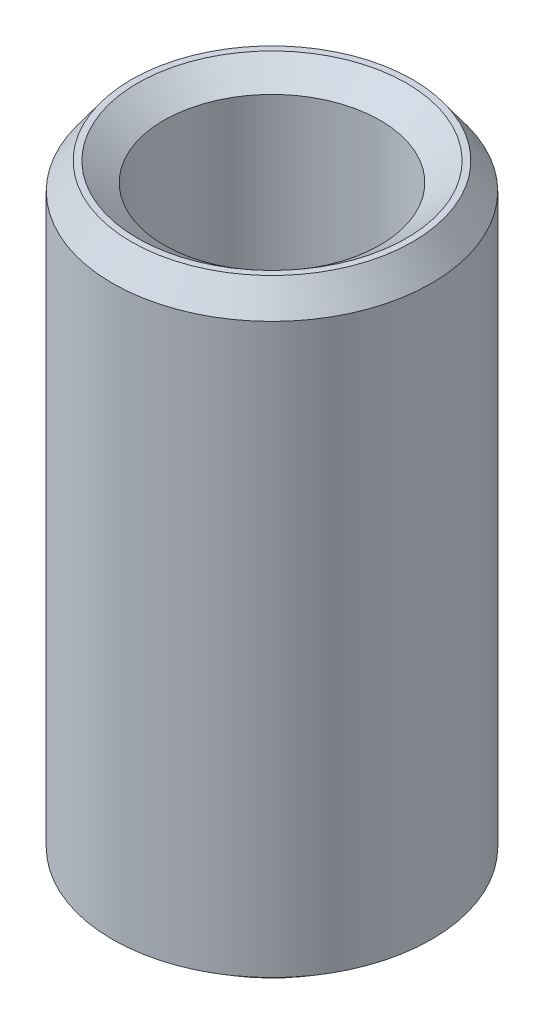
ISO-10303-21;
HEADER;
FILE_DESCRIPTION(('STEP AP214'),'2;1');
FILE_NAME('part.step','',(''),(''),'','','');
FILE_SCHEMA(('AUTOMOTIVE_DESIGN { 1 0 10303 214 1 1 1 1 }'));
ENDSEC;
DATA;
#1=APPLICATION_CONTEXT('core data for automotive mechanical design processes');
#2=APPLICATION_PROTOCOL_DEFINITION('international standard','automotive_design',2000,#1);
#3=PRODUCT_CONTEXT('',#1,'mechanical');
#4=PRODUCT('Part','Part','',(#3));
#5=PRODUCT_RELATED_PRODUCT_CATEGORY('part','',(#4));
#6=PRODUCT_DEFINITION_FORMATION('','',#4);
#7=PRODUCT_DEFINITION_CONTEXT('part definition',#1,'design');
#8=PRODUCT_DEFINITION('design','',#6,#7);
#9=PRODUCT_DEFINITION_SHAPE('','',#8);
#10=(LENGTH_UNIT() NAMED_UNIT(*) SI_UNIT(.MILLI.,.METRE.));
#11=(NAMED_UNIT(*) PLANE_ANGLE_UNIT() SI_UNIT($,.RADIAN.));
#12=(NAMED_UNIT(*) SI_UNIT($,.STERADIAN.) SOLID_ANGLE_UNIT());
#13=UNCERTAINTY_MEASURE_WITH_UNIT(LENGTH_MEASURE(1.E-05),#10,'distance_accuracy_value','');
#14=(GEOMETRIC_REPRESENTATION_CONTEXT(3) GLOBAL_UNCERTAINTY_ASSIGNED_CONTEXT((#13)) GLOBAL_UNIT_ASSIGNED_CONTEXT((#10,
#11,#12)) REPRESENTATION_CONTEXT('',''));
#15=CARTESIAN_POINT('',(0.,0.,0.));
#16=DIRECTION('',(0.,0.,1.));
#17=DIRECTION('',(1.,0.,0.));
#18=AXIS2_PLACEMENT_3D('',#15,#16,#17);
#19=CARTESIAN_POINT('',(0.,48.0463737221986,0.));
#20=DIRECTION('',(0.,-1.,0.));
#21=DIRECTION('',(0.,0.,-1.));
#22=AXIS2_PLACEMENT_3D('',#19,#20,#21);
#23=CYLINDRICAL_SURFACE('',#22,12.5);
#24=CARTESIAN_POINT('',(0.,1.48811052341752,0.));
#25=DIRECTION('',(0.,1.,0.));
#26=DIRECTION('',(0.,0.,1.));
#27=AXIS2_PLACEMENT_3D('',#24,#25,#26);
#28=CIRCLE('',#27,12.5);
#29=CARTESIAN_POINT('',(0.,1.48811052341752,12.5));
#30=VERTEX_POINT('',#29);
#31=EDGE_CURVE('E10',#30,#30,#28,.T.);
#32=ORIENTED_EDGE('',*,*,#31,.T.);
#33=EDGE_LOOP('',(#32));
#34=FACE_BOUND('',#33,.T.);
#35=CARTESIAN_POINT('',(0.,45.9845477257731,0.));
#36=DIRECTION('',(0.,1.,0.));
#37=DIRECTION('',(0.,0.,1.));
#38=AXIS2_PLACEMENT_3D('',#35,#36,#37);
#39=CIRCLE('',#38,12.5);
#40=CARTESIAN_POINT('',(0.,45.9845477257731,12.5));
#41=VERTEX_POINT('',#40);
#42=EDGE_CURVE('E50',#41,#41,#39,.F.);
#43=ORIENTED_EDGE('',*,*,#42,.T.);
#44=EDGE_LOOP('',(#43));
#45=FACE_BOUND('',#44,.T.);
#46=ADVANCED_FACE('F39',(#34,#45),#23,.T.);
#47=CARTESIAN_POINT('',(0.,48.0463737221986,0.));
#48=DIRECTION('',(0.,1.,0.));
#49=DIRECTION('',(0.,0.,1.));
#50=AXIS2_PLACEMENT_3D('',#47,#48,#49);
#51=PLANE('',#50);
#52=CARTESIAN_POINT('',(0.,48.0463737221986,0.));
#53=DIRECTION('',(0.,1.,0.));
#54=DIRECTION('',(0.,0.,1.));
#55=AXIS2_PLACEMENT_3D('',#52,#53,#54);
#56=CIRCLE('',#55,10.5271844383437);
#57=CARTESIAN_POINT('',(0.,48.0463737221986,10.5271844383437));
#58=VERTEX_POINT('',#57);
#59=EDGE_CURVE('E58',#58,#58,#56,.F.);
#60=ORIENTED_EDGE('',*,*,#59,.T.);
#61=EDGE_LOOP('',(#60));
#62=FACE_BOUND('',#61,.T.);
#63=CARTESIAN_POINT('',(0.,48.0463737221986,0.));
#64=DIRECTION('',(0.,1.,0.));
#65=DIRECTION('',(0.,0.,1.));
#66=AXIS2_PLACEMENT_3D('',#63,#64,#65);
#67=CIRCLE('',#66,11.0118894765825);
#68=CARTESIAN_POINT('',(0.,48.0463737221986,11.0118894765825));
#69=VERTEX_POINT('',#68);
#70=EDGE_CURVE('E61',#69,#69,#67,.T.);
#71=ORIENTED_EDGE('',*,*,#70,.T.);
#72=EDGE_LOOP('',(#71));
#73=FACE_BOUND('',#72,.T.);
#74=ADVANCED_FACE('F88',(#62,#73),#51,.T.);
#75=CARTESIAN_POINT('',(0.,0.,0.));
#76=DIRECTION('',(0.,1.,0.));
#77=DIRECTION('',(0.,0.,1.));
#78=AXIS2_PLACEMENT_3D('',#75,#76,#77);
#79=PLANE('',#78);
#80=CARTESIAN_POINT('',(0.,0.,0.));
#81=DIRECTION('',(0.,1.,0.));
#82=DIRECTION('',(0.,0.,1.));
#83=AXIS2_PLACEMENT_3D('',#80,#81,#82);
#84=CIRCLE('',#83,9.95346896533566);
#85=CARTESIAN_POINT('',(0.,0.,9.95346896533566));
#86=VERTEX_POINT('',#85);
#87=EDGE_CURVE('E51',#86,#86,#84,.T.);
#88=ORIENTED_EDGE('',*,*,#87,.T.);
#89=EDGE_LOOP('',(#88));
#90=FACE_BOUND('',#89,.T.);
#91=CARTESIAN_POINT('',(0.,0.,0.));
#92=DIRECTION('',(0.,1.,0.));
#93=DIRECTION('',(0.,0.,1.));
#94=AXIS2_PLACEMENT_3D('',#91,#92,#93);
#95=CIRCLE('',#94,10.4381740035745);
#96=CARTESIAN_POINT('',(0.,0.,10.4381740035745));
#97=VERTEX_POINT('',#96);
#98=EDGE_CURVE('E54',#97,#97,#95,.F.);
#99=ORIENTED_EDGE('',*,*,#98,.T.);
#100=EDGE_LOOP('',(#99));
#101=FACE_BOUND('',#100,.T.);
#102=ADVANCED_FACE('F83',(#90,#101),#79,.F.);
#103=CARTESIAN_POINT('',(0.,48.0463737221986,0.));
#104=DIRECTION('',(0.,-1.,0.));
#105=DIRECTION('',(0.,0.,-1.));
#106=AXIS2_PLACEMENT_3D('',#103,#104,#105);
#107=CYLINDRICAL_SURFACE('',#106,8.46535844191815);
#108=CARTESIAN_POINT('',(0.,46.5582631987811,0.));
#109=DIRECTION('',(0.,1.,0.));
#110=DIRECTION('',(0.,0.,1.));
#111=AXIS2_PLACEMENT_3D('',#108,#109,#110);
#112=CIRCLE('',#111,8.46535844191815);
#113=CARTESIAN_POINT('',(0.,46.5582631987811,8.46535844191815));
#114=VERTEX_POINT('',#113);
#115=EDGE_CURVE('E67',#114,#114,#112,.T.);
#116=ORIENTED_EDGE('',*,*,#115,.T.);
#117=EDGE_LOOP('',(#116));
#118=FACE_BOUND('',#117,.T.);
#119=CARTESIAN_POINT('',(0.,2.06182599642549,0.));
#120=DIRECTION('',(0.,1.,0.));
#121=DIRECTION('',(0.,0.,1.));
#122=AXIS2_PLACEMENT_3D('',#119,#120,#121);
#123=CIRCLE('',#122,8.46535844191815);
#124=CARTESIAN_POINT('',(0.,2.06182599642549,8.46535844191815));
#125=VERTEX_POINT('',#124);
#126=EDGE_CURVE('E69',#125,#125,#123,.F.);
#127=ORIENTED_EDGE('',*,*,#126,.T.);
#128=EDGE_LOOP('',(#127));
#129=FACE_BOUND('',#128,.T.);
#130=ADVANCED_FACE('F71',(#118,#129),#107,.F.);
#131=CARTESIAN_POINT('',(0.,46.5582631987811,0.));
#132=DIRECTION('',(0.,1.,0.));
#133=DIRECTION('',(0.,0.,1.));
#134=AXIS2_PLACEMENT_3D('',#131,#132,#133);
#135=CONICAL_SURFACE('',#134,8.46535844191815,0.945625651847247);
#136=ORIENTED_EDGE('',*,*,#59,.F.);
#137=EDGE_LOOP('',(#136));
#138=FACE_BOUND('',#137,.T.);
#139=ORIENTED_EDGE('',*,*,#115,.F.);
#140=EDGE_LOOP('',(#139));
#141=FACE_BOUND('',#140,.T.);
#142=ADVANCED_FACE('F77',(#138,#141),#135,.F.);
#143=CARTESIAN_POINT('',(0.,0.,0.));
#144=DIRECTION('',(0.,-1.,0.));
#145=DIRECTION('',(0.,0.,-1.));
#146=AXIS2_PLACEMENT_3D('',#143,#144,#145);
#147=CONICAL_SURFACE('',#146,9.95346896533566,0.625170674947651);
#148=ORIENTED_EDGE('',*,*,#126,.F.);
#149=EDGE_LOOP('',(#148));
#150=FACE_BOUND('',#149,.T.);
#151=ORIENTED_EDGE('',*,*,#87,.F.);
#152=EDGE_LOOP('',(#151));
#153=FACE_BOUND('',#152,.T.);
#154=ADVANCED_FACE('F73',(#150,#153),#147,.F.);
#155=CARTESIAN_POINT('',(0.,1.48811052341752,0.));
#156=DIRECTION('',(0.,1.,0.));
#157=DIRECTION('',(0.,0.,1.));
#158=AXIS2_PLACEMENT_3D('',#155,#156,#157);
#159=CONICAL_SURFACE('',#158,12.5,0.945625651847246);
#160=ORIENTED_EDGE('',*,*,#98,.F.);
#161=EDGE_LOOP('',(#160));
#162=FACE_BOUND('',#161,.T.);
#163=ORIENTED_EDGE('',*,*,#31,.F.);
#164=EDGE_LOOP('',(#163));
#165=FACE_BOUND('',#164,.T.);
#166=ADVANCED_FACE('F76',(#162,#165),#159,.T.);
#167=CARTESIAN_POINT('',(0.,48.0463737221986,0.));
#168=DIRECTION('',(0.,-1.,0.));
#169=DIRECTION('',(0.,0.,-1.));
#170=AXIS2_PLACEMENT_3D('',#167,#168,#169);
#171=CONICAL_SURFACE('',#170,11.0118894765825,0.62517067494765);
#172=ORIENTED_EDGE('',*,*,#42,.F.);
#173=EDGE_LOOP('',(#172));
#174=FACE_BOUND('',#173,.T.);
#175=ORIENTED_EDGE('',*,*,#70,.F.);
#176=EDGE_LOOP('',(#175));
#177=FACE_BOUND('',#176,.T.);
#178=ADVANCED_FACE('F45',(#174,#177),#171,.T.);
#179=CLOSED_SHELL('',(#46,#74,#102,#130,#142,#154,#166,#178));
#180=MANIFOLD_SOLID_BREP('B2',#179);
#181=ADVANCED_BREP_SHAPE_REPRESENTATION('',(#18,#180),#14);
#182=SHAPE_DEFINITION_REPRESENTATION(#9,#181);
ENDSEC;
END-ISO-10303-21;
